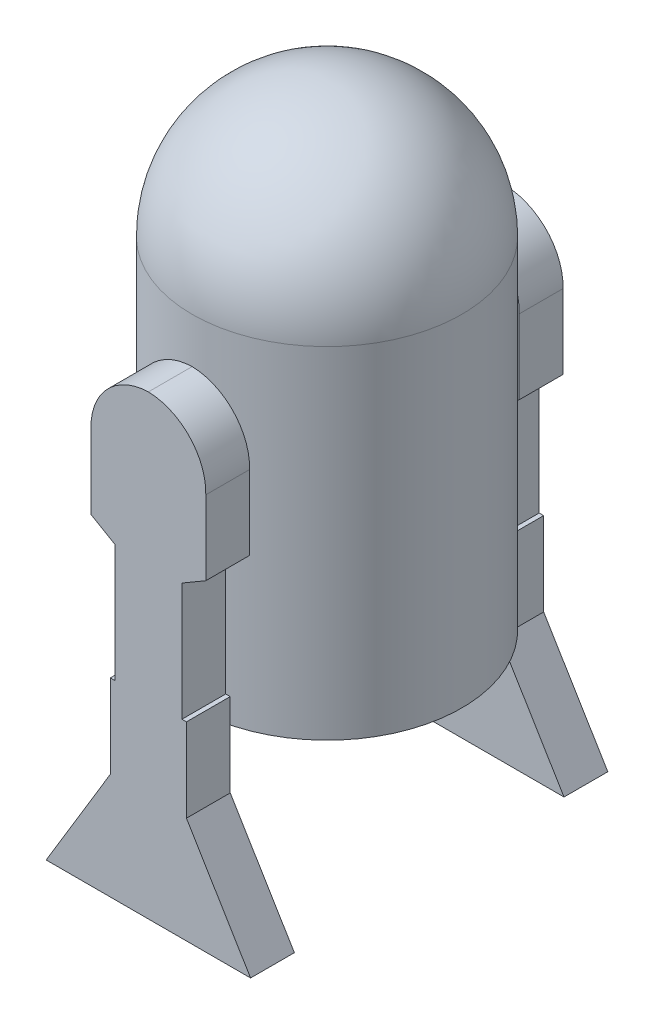
ISO-10303-21;
HEADER;
FILE_DESCRIPTION(('STEP AP214'),'2;1');
FILE_NAME('part.step','',(''),(''),'','','');
FILE_SCHEMA(('AUTOMOTIVE_DESIGN { 1 0 10303 214 1 1 1 1 }'));
ENDSEC;
DATA;
#1=APPLICATION_CONTEXT('core data for automotive mechanical design processes');
#2=APPLICATION_PROTOCOL_DEFINITION('international standard','automotive_design',2000,#1);
#3=PRODUCT_CONTEXT('',#1,'mechanical');
#4=PRODUCT('Part','Part','',(#3));
#5=PRODUCT_RELATED_PRODUCT_CATEGORY('part','',(#4));
#6=PRODUCT_DEFINITION_FORMATION('','',#4);
#7=PRODUCT_DEFINITION_CONTEXT('part definition',#1,'design');
#8=PRODUCT_DEFINITION('design','',#6,#7);
#9=PRODUCT_DEFINITION_SHAPE('','',#8);
#10=(LENGTH_UNIT() NAMED_UNIT(*) SI_UNIT(.MILLI.,.METRE.));
#11=(NAMED_UNIT(*) PLANE_ANGLE_UNIT() SI_UNIT($,.RADIAN.));
#12=(NAMED_UNIT(*) SI_UNIT($,.STERADIAN.) SOLID_ANGLE_UNIT());
#13=UNCERTAINTY_MEASURE_WITH_UNIT(LENGTH_MEASURE(1.E-05),#10,'distance_accuracy_value','');
#14=(GEOMETRIC_REPRESENTATION_CONTEXT(3) GLOBAL_UNCERTAINTY_ASSIGNED_CONTEXT((#13)) GLOBAL_UNIT_ASSIGNED_CONTEXT((#10,
#11,#12)) REPRESENTATION_CONTEXT('',''));
#15=CARTESIAN_POINT('',(0.,0.,0.));
#16=DIRECTION('',(0.,0.,1.));
#17=DIRECTION('',(1.,0.,0.));
#18=AXIS2_PLACEMENT_3D('',#15,#16,#17);
#19=CARTESIAN_POINT('',(2.62081152800423,683.452730750432,305.869874894946));
#20=DIRECTION('',(0.,0.,-1.));
#21=DIRECTION('',(1.,0.,0.));
#22=AXIS2_PLACEMENT_3D('',#19,#20,#21);
#23=CYLINDRICAL_SURFACE('',#22,100.957677938701);
#24=CARTESIAN_POINT('',(2.62081152800423,683.452730750432,230.869874894946));
#25=DIRECTION('',(0.,0.,-1.));
#26=DIRECTION('',(-1.,0.,0.));
#27=AXIS2_PLACEMENT_3D('',#24,#25,#26);
#28=CIRCLE('',#27,100.957677938701);
#29=CARTESIAN_POINT('',(-98.3028431903483,680.831919222428,230.869874894946));
#30=VERTEX_POINT('',#29);
#31=CARTESIAN_POINT('',(0.,784.376385468785,230.869874894946));
#32=VERTEX_POINT('',#31);
#33=EDGE_CURVE('E193',#30,#32,#28,.T.);
#34=ORIENTED_EDGE('',*,*,#33,.F.);
#35=DIRECTION('',(0.,0.,-1.));
#36=VECTOR('',#35,1.);
#37=CARTESIAN_POINT('',(-98.3028431903483,680.831919222428,305.869874894946));
#38=LINE('',#37,#36);
#39=CARTESIAN_POINT('',(-98.3028431903483,680.831919222428,305.869874894946));
#40=VERTEX_POINT('',#39);
#41=EDGE_CURVE('E192',#40,#30,#38,.T.);
#42=ORIENTED_EDGE('',*,*,#41,.F.);
#43=CARTESIAN_POINT('',(2.62081152800423,683.452730750432,305.869874894946));
#44=DIRECTION('',(0.,0.,-1.));
#45=DIRECTION('',(-1.,0.,0.));
#46=AXIS2_PLACEMENT_3D('',#43,#44,#45);
#47=CIRCLE('',#46,100.957677938701);
#48=CARTESIAN_POINT('',(0.,784.376385468785,305.869874894946));
#49=VERTEX_POINT('',#48);
#50=EDGE_CURVE('E232',#40,#49,#47,.T.);
#51=ORIENTED_EDGE('',*,*,#50,.T.);
#52=DIRECTION('',(0.,0.,-1.));
#53=VECTOR('',#52,1.);
#54=CARTESIAN_POINT('',(0.,784.376385468785,305.869874894946));
#55=LINE('',#54,#53);
#56=EDGE_CURVE('E12',#49,#32,#55,.T.);
#57=ORIENTED_EDGE('',*,*,#56,.T.);
#58=EDGE_LOOP('',(#34,#42,#51,#57));
#59=FACE_BOUND('',#58,.T.);
#60=ADVANCED_FACE('F55',(#59),#23,.T.);
#61=CARTESIAN_POINT('',(-2.62081152800423,683.452730750432,305.869874894946));
#62=DIRECTION('',(0.,0.,-1.));
#63=DIRECTION('',(1.,0.,0.));
#64=AXIS2_PLACEMENT_3D('',#61,#62,#63);
#65=CYLINDRICAL_SURFACE('',#64,100.957677938701);
#66=CARTESIAN_POINT('',(-2.62081152800423,683.452730750432,230.869874894946));
#67=DIRECTION('',(0.,0.,-1.));
#68=DIRECTION('',(1.,0.,0.));
#69=AXIS2_PLACEMENT_3D('',#66,#67,#68);
#70=CIRCLE('',#69,100.957677938701);
#71=CARTESIAN_POINT('',(98.3028431903483,680.831919222428,230.869874894946));
#72=VERTEX_POINT('',#71);
#73=EDGE_CURVE('E195',#32,#72,#70,.T.);
#74=ORIENTED_EDGE('',*,*,#73,.F.);
#75=ORIENTED_EDGE('',*,*,#56,.F.);
#76=CARTESIAN_POINT('',(-2.62081152800423,683.452730750432,305.869874894946));
#77=DIRECTION('',(0.,0.,-1.));
#78=DIRECTION('',(1.,0.,0.));
#79=AXIS2_PLACEMENT_3D('',#76,#77,#78);
#80=CIRCLE('',#79,100.957677938701);
#81=CARTESIAN_POINT('',(98.3028431903483,680.831919222428,305.869874894946));
#82=VERTEX_POINT('',#81);
#83=EDGE_CURVE('E130',#49,#82,#80,.T.);
#84=ORIENTED_EDGE('',*,*,#83,.T.);
#85=DIRECTION('',(0.,0.,-1.));
#86=VECTOR('',#85,1.);
#87=CARTESIAN_POINT('',(98.3028431903483,680.831919222428,305.869874894946));
#88=LINE('',#87,#86);
#89=EDGE_CURVE('E63',#82,#72,#88,.T.);
#90=ORIENTED_EDGE('',*,*,#89,.T.);
#91=EDGE_LOOP('',(#74,#75,#84,#90));
#92=FACE_BOUND('',#91,.T.);
#93=ADVANCED_FACE('F265',(#92),#65,.T.);
#94=CARTESIAN_POINT('',(98.3028431903483,680.831919222428,305.869874894946));
#95=DIRECTION('',(-1.,0.,0.));
#96=DIRECTION('',(0.,0.,-1.));
#97=AXIS2_PLACEMENT_3D('',#94,#95,#96);
#98=PLANE('',#97);
#99=DIRECTION('',(0.,-1.,0.));
#100=VECTOR('',#99,1.);
#101=CARTESIAN_POINT('',(98.3028431903483,680.831919222428,230.869874894946));
#102=LINE('',#101,#100);
#103=CARTESIAN_POINT('',(98.3028431903483,553.465340717842,230.869874894946));
#104=VERTEX_POINT('',#103);
#105=EDGE_CURVE('E198',#72,#104,#102,.T.);
#106=ORIENTED_EDGE('',*,*,#105,.F.);
#107=ORIENTED_EDGE('',*,*,#89,.F.);
#108=DIRECTION('',(0.,-1.,0.));
#109=VECTOR('',#108,1.);
#110=CARTESIAN_POINT('',(98.3028431903483,680.831919222428,305.869874894946));
#111=LINE('',#110,#109);
#112=CARTESIAN_POINT('',(98.3028431903483,553.465340717842,305.869874894946));
#113=VERTEX_POINT('',#112);
#114=EDGE_CURVE('E274',#82,#113,#111,.T.);
#115=ORIENTED_EDGE('',*,*,#114,.T.);
#116=DIRECTION('',(0.,0.,-1.));
#117=VECTOR('',#116,1.);
#118=CARTESIAN_POINT('',(98.3028431903483,553.465340717842,305.869874894946));
#119=LINE('',#118,#117);
#120=EDGE_CURVE('E260',#113,#104,#119,.T.);
#121=ORIENTED_EDGE('',*,*,#120,.T.);
#122=EDGE_LOOP('',(#106,#107,#115,#121));
#123=FACE_BOUND('',#122,.T.);
#124=ADVANCED_FACE('F326',(#123),#98,.F.);
#125=CARTESIAN_POINT('',(98.3028431903483,553.465340717842,305.869874894946));
#126=DIRECTION('',(-0.504427537965022,0.86345402827397,0.));
#127=DIRECTION('',(-0.86345402827397,-0.504427537965022,0.));
#128=AXIS2_PLACEMENT_3D('',#125,#126,#127);
#129=PLANE('',#128);
#130=DIRECTION('',(-0.86345402827397,-0.504427537965022,0.));
#131=VECTOR('',#130,1.);
#132=CARTESIAN_POINT('',(98.3028431903483,553.465340717842,230.869874894946));
#133=LINE('',#132,#131);
#134=CARTESIAN_POINT('',(57.4430910383442,529.595182602885,230.869874894946));
#135=VERTEX_POINT('',#134);
#136=EDGE_CURVE('E201',#104,#135,#133,.T.);
#137=ORIENTED_EDGE('',*,*,#136,.F.);
#138=ORIENTED_EDGE('',*,*,#120,.F.);
#139=DIRECTION('',(-0.86345402827397,-0.504427537965022,0.));
#140=VECTOR('',#139,1.);
#141=CARTESIAN_POINT('',(98.3028431903483,553.465340717842,305.869874894946));
#142=LINE('',#141,#140);
#143=CARTESIAN_POINT('',(57.4430910383442,529.595182602885,305.869874894946));
#144=VERTEX_POINT('',#143);
#145=EDGE_CURVE('E278',#113,#144,#142,.T.);
#146=ORIENTED_EDGE('',*,*,#145,.T.);
#147=DIRECTION('',(0.,0.,-1.));
#148=VECTOR('',#147,1.);
#149=CARTESIAN_POINT('',(57.4430910383442,529.595182602885,305.869874894946));
#150=LINE('',#149,#148);
#151=EDGE_CURVE('E257',#144,#135,#150,.T.);
#152=ORIENTED_EDGE('',*,*,#151,.T.);
#153=EDGE_LOOP('',(#137,#138,#146,#152));
#154=FACE_BOUND('',#153,.T.);
#155=ADVANCED_FACE('F325',(#154),#129,.F.);
#156=CARTESIAN_POINT('',(57.4430910383442,529.595182602885,305.869874894946));
#157=DIRECTION('',(-1.,0.,0.));
#158=DIRECTION('',(0.,0.,-1.));
#159=AXIS2_PLACEMENT_3D('',#156,#157,#158);
#160=PLANE('',#159);
#161=DIRECTION('',(0.,-1.,0.));
#162=VECTOR('',#161,1.);
#163=CARTESIAN_POINT('',(57.4430910383442,529.595182602885,230.869874894946));
#164=LINE('',#163,#162);
#165=CARTESIAN_POINT('',(57.4430910383442,327.575952081145,230.869874894946));
#166=VERTEX_POINT('',#165);
#167=EDGE_CURVE('E204',#135,#166,#164,.T.);
#168=ORIENTED_EDGE('',*,*,#167,.F.);
#169=ORIENTED_EDGE('',*,*,#151,.F.);
#170=DIRECTION('',(0.,-1.,0.));
#171=VECTOR('',#170,1.);
#172=CARTESIAN_POINT('',(57.4430910383442,529.595182602885,305.869874894946));
#173=LINE('',#172,#171);
#174=CARTESIAN_POINT('',(57.4430910383442,327.575952081145,305.869874894946));
#175=VERTEX_POINT('',#174);
#176=EDGE_CURVE('E281',#144,#175,#173,.T.);
#177=ORIENTED_EDGE('',*,*,#176,.T.);
#178=DIRECTION('',(0.,0.,-1.));
#179=VECTOR('',#178,1.);
#180=CARTESIAN_POINT('',(57.4430910383442,327.575952081145,305.869874894946));
#181=LINE('',#180,#179);
#182=EDGE_CURVE('E254',#175,#166,#181,.T.);
#183=ORIENTED_EDGE('',*,*,#182,.T.);
#184=EDGE_LOOP('',(#168,#169,#177,#183));
#185=FACE_BOUND('',#184,.T.);
#186=ADVANCED_FACE('F323',(#185),#160,.F.);
#187=CARTESIAN_POINT('',(57.4430910383442,327.575952081145,305.869874894946));
#188=DIRECTION('',(0.,-1.,0.));
#189=DIRECTION('',(0.,0.,1.));
#190=AXIS2_PLACEMENT_3D('',#187,#188,#189);
#191=PLANE('',#190);
#192=DIRECTION('',(1.,0.,0.));
#193=VECTOR('',#192,1.);
#194=CARTESIAN_POINT('',(57.4430910383442,327.575952081145,230.869874894946));
#195=LINE('',#194,#193);
#196=CARTESIAN_POINT('',(65.1517277548361,327.575952081145,230.869874894946));
#197=VERTEX_POINT('',#196);
#198=EDGE_CURVE('E207',#166,#197,#195,.T.);
#199=ORIENTED_EDGE('',*,*,#198,.F.);
#200=ORIENTED_EDGE('',*,*,#182,.F.);
#201=DIRECTION('',(1.,0.,0.));
#202=VECTOR('',#201,1.);
#203=CARTESIAN_POINT('',(57.4430910383442,327.575952081145,305.869874894946));
#204=LINE('',#203,#202);
#205=CARTESIAN_POINT('',(65.1517277548361,327.575952081145,305.869874894946));
#206=VERTEX_POINT('',#205);
#207=EDGE_CURVE('E284',#175,#206,#204,.T.);
#208=ORIENTED_EDGE('',*,*,#207,.T.);
#209=DIRECTION('',(0.,0.,-1.));
#210=VECTOR('',#209,1.);
#211=CARTESIAN_POINT('',(65.1517277548361,327.575952081145,305.869874894946));
#212=LINE('',#211,#210);
#213=EDGE_CURVE('E251',#206,#197,#212,.T.);
#214=ORIENTED_EDGE('',*,*,#213,.T.);
#215=EDGE_LOOP('',(#199,#200,#208,#214));
#216=FACE_BOUND('',#215,.T.);
#217=ADVANCED_FACE('F319',(#216),#191,.F.);
#218=CARTESIAN_POINT('',(65.1517277548361,327.575952081145,305.869874894946));
#219=DIRECTION('',(-1.,0.,0.));
#220=DIRECTION('',(0.,0.,-1.));
#221=AXIS2_PLACEMENT_3D('',#218,#219,#220);
#222=PLANE('',#221);
#223=DIRECTION('',(0.,-1.,0.));
#224=VECTOR('',#223,1.);
#225=CARTESIAN_POINT('',(65.1517277548361,327.575952081145,230.869874894946));
#226=LINE('',#225,#224);
#227=CARTESIAN_POINT('',(65.1517277548361,184.684592199182,230.869874894946));
#228=VERTEX_POINT('',#227);
#229=EDGE_CURVE('E210',#197,#228,#226,.T.);
#230=ORIENTED_EDGE('',*,*,#229,.F.);
#231=ORIENTED_EDGE('',*,*,#213,.F.);
#232=DIRECTION('',(0.,-1.,0.));
#233=VECTOR('',#232,1.);
#234=CARTESIAN_POINT('',(65.1517277548361,327.575952081145,305.869874894946));
#235=LINE('',#234,#233);
#236=CARTESIAN_POINT('',(65.1517277548361,184.684592199182,305.869874894946));
#237=VERTEX_POINT('',#236);
#238=EDGE_CURVE('E287',#206,#237,#235,.T.);
#239=ORIENTED_EDGE('',*,*,#238,.T.);
#240=DIRECTION('',(0.,0.,-1.));
#241=VECTOR('',#240,1.);
#242=CARTESIAN_POINT('',(65.1517277548361,184.684592199182,305.869874894946));
#243=LINE('',#242,#241);
#244=EDGE_CURVE('E248',#237,#228,#243,.T.);
#245=ORIENTED_EDGE('',*,*,#244,.T.);
#246=EDGE_LOOP('',(#230,#231,#239,#245));
#247=FACE_BOUND('',#246,.T.);
#248=ADVANCED_FACE('F316',(#247),#222,.F.);
#249=CARTESIAN_POINT('',(175.,2.63696693908866,305.869874894946));
#250=DIRECTION('',(-0.856204415699511,-0.51663720204478,0.));
#251=DIRECTION('',(0.51663720204478,-0.856204415699511,0.));
#252=AXIS2_PLACEMENT_3D('',#249,#250,#251);
#253=PLANE('',#252);
#254=DIRECTION('',(0.51663720204478,-0.856204415699511,0.));
#255=VECTOR('',#254,1.);
#256=CARTESIAN_POINT('',(175.,2.63696693908866,230.869874894946));
#257=LINE('',#256,#255);
#258=CARTESIAN_POINT('',(175.,2.63696693908866,230.869874894946));
#259=VERTEX_POINT('',#258);
#260=EDGE_CURVE('E213',#228,#259,#257,.T.);
#261=ORIENTED_EDGE('',*,*,#260,.F.);
#262=ORIENTED_EDGE('',*,*,#244,.F.);
#263=DIRECTION('',(0.51663720204478,-0.856204415699511,0.));
#264=VECTOR('',#263,1.);
#265=CARTESIAN_POINT('',(175.,2.63696693908866,305.869874894946));
#266=LINE('',#265,#264);
#267=CARTESIAN_POINT('',(175.,2.63696693908866,305.869874894946));
#268=VERTEX_POINT('',#267);
#269=EDGE_CURVE('E290',#237,#268,#266,.T.);
#270=ORIENTED_EDGE('',*,*,#269,.T.);
#271=DIRECTION('',(0.,0.,-1.));
#272=VECTOR('',#271,1.);
#273=CARTESIAN_POINT('',(175.,2.63696693908866,305.869874894946));
#274=LINE('',#273,#272);
#275=EDGE_CURVE('E245',#268,#259,#274,.T.);
#276=ORIENTED_EDGE('',*,*,#275,.T.);
#277=EDGE_LOOP('',(#261,#262,#270,#276));
#278=FACE_BOUND('',#277,.T.);
#279=ADVANCED_FACE('F314',(#278),#253,.F.);
#280=CARTESIAN_POINT('',(175.,2.63696693908866,305.869874894946));
#281=DIRECTION('',(0.,1.,0.));
#282=DIRECTION('',(0.,0.,-1.));
#283=AXIS2_PLACEMENT_3D('',#280,#281,#282);
#284=PLANE('',#283);
#285=DIRECTION('',(-1.,0.,0.));
#286=VECTOR('',#285,1.);
#287=CARTESIAN_POINT('',(175.,2.63696693908866,230.869874894946));
#288=LINE('',#287,#286);
#289=CARTESIAN_POINT('',(-175.,2.63696693908866,230.869874894946));
#290=VERTEX_POINT('',#289);
#291=EDGE_CURVE('E216',#259,#290,#288,.T.);
#292=ORIENTED_EDGE('',*,*,#291,.F.);
#293=ORIENTED_EDGE('',*,*,#275,.F.);
#294=DIRECTION('',(-1.,0.,0.));
#295=VECTOR('',#294,1.);
#296=CARTESIAN_POINT('',(175.,2.63696693908866,305.869874894946));
#297=LINE('',#296,#295);
#298=CARTESIAN_POINT('',(-175.,2.63696693908866,305.869874894946));
#299=VERTEX_POINT('',#298);
#300=EDGE_CURVE('E293',#268,#299,#297,.T.);
#301=ORIENTED_EDGE('',*,*,#300,.T.);
#302=DIRECTION('',(0.,0.,-1.));
#303=VECTOR('',#302,1.);
#304=CARTESIAN_POINT('',(-175.,2.63696693908866,305.869874894946));
#305=LINE('',#304,#303);
#306=EDGE_CURVE('E242',#299,#290,#305,.T.);
#307=ORIENTED_EDGE('',*,*,#306,.T.);
#308=EDGE_LOOP('',(#292,#293,#301,#307));
#309=FACE_BOUND('',#308,.T.);
#310=ADVANCED_FACE('F310',(#309),#284,.F.);
#311=CARTESIAN_POINT('',(-175.,2.63696693908866,305.869874894946));
#312=DIRECTION('',(0.856204415699511,-0.51663720204478,0.));
#313=DIRECTION('',(0.51663720204478,0.856204415699511,0.));
#314=AXIS2_PLACEMENT_3D('',#311,#312,#313);
#315=PLANE('',#314);
#316=DIRECTION('',(0.51663720204478,0.856204415699511,0.));
#317=VECTOR('',#316,1.);
#318=CARTESIAN_POINT('',(-175.,2.63696693908866,230.869874894946));
#319=LINE('',#318,#317);
#320=CARTESIAN_POINT('',(-65.1517277548361,184.684592199182,230.869874894946));
#321=VERTEX_POINT('',#320);
#322=EDGE_CURVE('E219',#290,#321,#319,.T.);
#323=ORIENTED_EDGE('',*,*,#322,.F.);
#324=ORIENTED_EDGE('',*,*,#306,.F.);
#325=DIRECTION('',(0.51663720204478,0.856204415699511,0.));
#326=VECTOR('',#325,1.);
#327=CARTESIAN_POINT('',(-175.,2.63696693908866,305.869874894946));
#328=LINE('',#327,#326);
#329=CARTESIAN_POINT('',(-65.1517277548361,184.684592199182,305.869874894946));
#330=VERTEX_POINT('',#329);
#331=EDGE_CURVE('E296',#299,#330,#328,.T.);
#332=ORIENTED_EDGE('',*,*,#331,.T.);
#333=DIRECTION('',(0.,0.,-1.));
#334=VECTOR('',#333,1.);
#335=CARTESIAN_POINT('',(-65.1517277548361,184.684592199182,305.869874894946));
#336=LINE('',#335,#334);
#337=EDGE_CURVE('E239',#330,#321,#336,.T.);
#338=ORIENTED_EDGE('',*,*,#337,.T.);
#339=EDGE_LOOP('',(#323,#324,#332,#338));
#340=FACE_BOUND('',#339,.T.);
#341=ADVANCED_FACE('F307',(#340),#315,.F.);
#342=CARTESIAN_POINT('',(-65.1517277548361,327.575952081145,305.869874894946));
#343=DIRECTION('',(1.,0.,0.));
#344=DIRECTION('',(0.,0.,1.));
#345=AXIS2_PLACEMENT_3D('',#342,#343,#344);
#346=PLANE('',#345);
#347=DIRECTION('',(0.,1.,0.));
#348=VECTOR('',#347,1.);
#349=CARTESIAN_POINT('',(-65.1517277548361,327.575952081145,230.869874894946));
#350=LINE('',#349,#348);
#351=CARTESIAN_POINT('',(-65.1517277548361,327.575952081145,230.869874894946));
#352=VERTEX_POINT('',#351);
#353=EDGE_CURVE('E222',#321,#352,#350,.T.);
#354=ORIENTED_EDGE('',*,*,#353,.F.);
#355=ORIENTED_EDGE('',*,*,#337,.F.);
#356=DIRECTION('',(0.,1.,0.));
#357=VECTOR('',#356,1.);
#358=CARTESIAN_POINT('',(-65.1517277548361,327.575952081145,305.869874894946));
#359=LINE('',#358,#357);
#360=CARTESIAN_POINT('',(-65.1517277548361,327.575952081145,305.869874894946));
#361=VERTEX_POINT('',#360);
#362=EDGE_CURVE('E187',#330,#361,#359,.T.);
#363=ORIENTED_EDGE('',*,*,#362,.T.);
#364=DIRECTION('',(0.,0.,-1.));
#365=VECTOR('',#364,1.);
#366=CARTESIAN_POINT('',(-65.1517277548361,327.575952081145,305.869874894946));
#367=LINE('',#366,#365);
#368=EDGE_CURVE('E236',#361,#352,#367,.T.);
#369=ORIENTED_EDGE('',*,*,#368,.T.);
#370=EDGE_LOOP('',(#354,#355,#363,#369));
#371=FACE_BOUND('',#370,.T.);
#372=ADVANCED_FACE('F301',(#371),#346,.F.);
#373=CARTESIAN_POINT('',(-57.4430910383442,327.575952081145,305.869874894946));
#374=DIRECTION('',(0.,-1.,0.));
#375=DIRECTION('',(0.,0.,1.));
#376=AXIS2_PLACEMENT_3D('',#373,#374,#375);
#377=PLANE('',#376);
#378=DIRECTION('',(1.,0.,0.));
#379=VECTOR('',#378,1.);
#380=CARTESIAN_POINT('',(-57.4430910383442,327.575952081145,230.869874894946));
#381=LINE('',#380,#379);
#382=CARTESIAN_POINT('',(-57.4430910383442,327.575952081145,230.869874894946));
#383=VERTEX_POINT('',#382);
#384=EDGE_CURVE('E225',#352,#383,#381,.T.);
#385=ORIENTED_EDGE('',*,*,#384,.F.);
#386=ORIENTED_EDGE('',*,*,#368,.F.);
#387=DIRECTION('',(1.,0.,0.));
#388=VECTOR('',#387,1.);
#389=CARTESIAN_POINT('',(-57.4430910383442,327.575952081145,305.869874894946));
#390=LINE('',#389,#388);
#391=CARTESIAN_POINT('',(-57.4430910383442,327.575952081145,305.869874894946));
#392=VERTEX_POINT('',#391);
#393=EDGE_CURVE('E185',#361,#392,#390,.T.);
#394=ORIENTED_EDGE('',*,*,#393,.T.);
#395=DIRECTION('',(0.,0.,-1.));
#396=VECTOR('',#395,1.);
#397=CARTESIAN_POINT('',(-57.4430910383442,327.575952081145,305.869874894946));
#398=LINE('',#397,#396);
#399=EDGE_CURVE('E179',#392,#383,#398,.T.);
#400=ORIENTED_EDGE('',*,*,#399,.T.);
#401=EDGE_LOOP('',(#385,#386,#394,#400));
#402=FACE_BOUND('',#401,.T.);
#403=ADVANCED_FACE('F305',(#402),#377,.F.);
#404=CARTESIAN_POINT('',(-57.4430910383442,529.595182602885,305.869874894946));
#405=DIRECTION('',(1.,0.,0.));
#406=DIRECTION('',(0.,0.,1.));
#407=AXIS2_PLACEMENT_3D('',#404,#405,#406);
#408=PLANE('',#407);
#409=DIRECTION('',(0.,1.,0.));
#410=VECTOR('',#409,1.);
#411=CARTESIAN_POINT('',(-57.4430910383442,529.595182602885,230.869874894946));
#412=LINE('',#411,#410);
#413=CARTESIAN_POINT('',(-57.4430910383442,529.595182602885,230.869874894946));
#414=VERTEX_POINT('',#413);
#415=EDGE_CURVE('E228',#383,#414,#412,.T.);
#416=ORIENTED_EDGE('',*,*,#415,.F.);
#417=ORIENTED_EDGE('',*,*,#399,.F.);
#418=DIRECTION('',(0.,1.,0.));
#419=VECTOR('',#418,1.);
#420=CARTESIAN_POINT('',(-57.4430910383442,529.595182602885,305.869874894946));
#421=LINE('',#420,#419);
#422=CARTESIAN_POINT('',(-57.4430910383442,529.595182602885,305.869874894946));
#423=VERTEX_POINT('',#422);
#424=EDGE_CURVE('E169',#392,#423,#421,.T.);
#425=ORIENTED_EDGE('',*,*,#424,.T.);
#426=DIRECTION('',(0.,0.,-1.));
#427=VECTOR('',#426,1.);
#428=CARTESIAN_POINT('',(-57.4430910383442,529.595182602885,305.869874894946));
#429=LINE('',#428,#427);
#430=EDGE_CURVE('E174',#423,#414,#429,.T.);
#431=ORIENTED_EDGE('',*,*,#430,.T.);
#432=EDGE_LOOP('',(#416,#417,#425,#431));
#433=FACE_BOUND('',#432,.T.);
#434=ADVANCED_FACE('F182',(#433),#408,.F.);
#435=CARTESIAN_POINT('',(-98.3028431903483,553.465340717842,305.869874894946));
#436=DIRECTION('',(0.504427537965022,0.86345402827397,0.));
#437=DIRECTION('',(-0.86345402827397,0.504427537965022,0.));
#438=AXIS2_PLACEMENT_3D('',#435,#436,#437);
#439=PLANE('',#438);
#440=DIRECTION('',(-0.86345402827397,0.504427537965022,0.));
#441=VECTOR('',#440,1.);
#442=CARTESIAN_POINT('',(-98.3028431903483,553.465340717842,230.869874894946));
#443=LINE('',#442,#441);
#444=CARTESIAN_POINT('',(-98.3028431903483,553.465340717842,230.869874894946));
#445=VERTEX_POINT('',#444);
#446=EDGE_CURVE('E176',#414,#445,#443,.T.);
#447=ORIENTED_EDGE('',*,*,#446,.F.);
#448=ORIENTED_EDGE('',*,*,#430,.F.);
#449=DIRECTION('',(-0.86345402827397,0.504427537965022,0.));
#450=VECTOR('',#449,1.);
#451=CARTESIAN_POINT('',(-98.3028431903483,553.465340717842,305.869874894946));
#452=LINE('',#451,#450);
#453=CARTESIAN_POINT('',(-98.3028431903483,553.465340717842,305.869874894946));
#454=VERTEX_POINT('',#453);
#455=EDGE_CURVE('E165',#423,#454,#452,.T.);
#456=ORIENTED_EDGE('',*,*,#455,.T.);
#457=DIRECTION('',(0.,0.,-1.));
#458=VECTOR('',#457,1.);
#459=CARTESIAN_POINT('',(-98.3028431903483,553.465340717842,305.869874894946));
#460=LINE('',#459,#458);
#461=EDGE_CURVE('E180',#454,#445,#460,.T.);
#462=ORIENTED_EDGE('',*,*,#461,.T.);
#463=EDGE_LOOP('',(#447,#448,#456,#462));
#464=FACE_BOUND('',#463,.T.);
#465=ADVANCED_FACE('F175',(#464),#439,.F.);
#466=CARTESIAN_POINT('',(-98.3028431903483,680.831919222428,305.869874894946));
#467=DIRECTION('',(1.,0.,0.));
#468=DIRECTION('',(0.,0.,1.));
#469=AXIS2_PLACEMENT_3D('',#466,#467,#468);
#470=PLANE('',#469);
#471=DIRECTION('',(0.,1.,0.));
#472=VECTOR('',#471,1.);
#473=CARTESIAN_POINT('',(-98.3028431903483,680.831919222428,230.869874894946));
#474=LINE('',#473,#472);
#475=EDGE_CURVE('E118',#445,#30,#474,.T.);
#476=ORIENTED_EDGE('',*,*,#475,.F.);
#477=ORIENTED_EDGE('',*,*,#461,.F.);
#478=DIRECTION('',(0.,1.,0.));
#479=VECTOR('',#478,1.);
#480=CARTESIAN_POINT('',(-98.3028431903483,680.831919222428,305.869874894946));
#481=LINE('',#480,#479);
#482=EDGE_CURVE('E71',#454,#40,#481,.T.);
#483=ORIENTED_EDGE('',*,*,#482,.T.);
#484=ORIENTED_EDGE('',*,*,#41,.T.);
#485=EDGE_LOOP('',(#476,#477,#483,#484));
#486=FACE_BOUND('',#485,.T.);
#487=ADVANCED_FACE('F432',(#486),#470,.F.);
#488=CARTESIAN_POINT('',(2.62081152800423,683.452730750432,305.869874894946));
#489=DIRECTION('',(0.,0.,1.));
#490=DIRECTION('',(-1.,0.,0.));
#491=AXIS2_PLACEMENT_3D('',#488,#489,#490);
#492=PLANE('',#491);
#493=ORIENTED_EDGE('',*,*,#50,.F.);
#494=ORIENTED_EDGE('',*,*,#482,.F.);
#495=ORIENTED_EDGE('',*,*,#455,.F.);
#496=ORIENTED_EDGE('',*,*,#424,.F.);
#497=ORIENTED_EDGE('',*,*,#393,.F.);
#498=ORIENTED_EDGE('',*,*,#362,.F.);
#499=ORIENTED_EDGE('',*,*,#331,.F.);
#500=ORIENTED_EDGE('',*,*,#300,.F.);
#501=ORIENTED_EDGE('',*,*,#269,.F.);
#502=ORIENTED_EDGE('',*,*,#238,.F.);
#503=ORIENTED_EDGE('',*,*,#207,.F.);
#504=ORIENTED_EDGE('',*,*,#176,.F.);
#505=ORIENTED_EDGE('',*,*,#145,.F.);
#506=ORIENTED_EDGE('',*,*,#114,.F.);
#507=ORIENTED_EDGE('',*,*,#83,.F.);
#508=EDGE_LOOP('',(#493,#494,#495,#496,#497,#498,#499,#500,#501,#502,#503,#504,#505,#506,#507));
#509=FACE_BOUND('',#508,.T.);
#510=ADVANCED_FACE('F167',(#509),#492,.T.);
#511=CARTESIAN_POINT('',(2.62081152800423,683.452730750432,230.869874894946));
#512=DIRECTION('',(0.,0.,1.));
#513=DIRECTION('',(-1.,0.,0.));
#514=AXIS2_PLACEMENT_3D('',#511,#512,#513);
#515=PLANE('',#514);
#516=ORIENTED_EDGE('',*,*,#33,.T.);
#517=ORIENTED_EDGE('',*,*,#73,.T.);
#518=ORIENTED_EDGE('',*,*,#105,.T.);
#519=ORIENTED_EDGE('',*,*,#136,.T.);
#520=ORIENTED_EDGE('',*,*,#167,.T.);
#521=ORIENTED_EDGE('',*,*,#198,.T.);
#522=ORIENTED_EDGE('',*,*,#229,.T.);
#523=ORIENTED_EDGE('',*,*,#260,.T.);
#524=ORIENTED_EDGE('',*,*,#291,.T.);
#525=ORIENTED_EDGE('',*,*,#322,.T.);
#526=ORIENTED_EDGE('',*,*,#353,.T.);
#527=ORIENTED_EDGE('',*,*,#384,.T.);
#528=ORIENTED_EDGE('',*,*,#415,.T.);
#529=ORIENTED_EDGE('',*,*,#446,.T.);
#530=ORIENTED_EDGE('',*,*,#475,.T.);
#531=EDGE_LOOP('',(#516,#517,#518,#519,#520,#521,#522,#523,#524,#525,#526,#527,#528,#529,#530));
#532=FACE_BOUND('',#531,.T.);
#533=ADVANCED_FACE('F268',(#532),#515,.F.);
#534=CLOSED_SHELL('',(#60,#93,#124,#155,#186,#217,#248,#279,#310,#341,#372,#403,#434,#465,#487,
#510,#533));
#535=MANIFOLD_SOLID_BREP('B2',#534);
#536=CARTESIAN_POINT('',(2.62081152800423,683.452730750432,-305.869874894946));
#537=DIRECTION('',(0.,0.,1.));
#538=DIRECTION('',(1.,0.,0.));
#539=AXIS2_PLACEMENT_3D('',#536,#537,#538);
#540=CYLINDRICAL_SURFACE('',#539,100.957677938701);
#541=CARTESIAN_POINT('',(2.62081152800423,683.452730750432,-230.869874894946));
#542=DIRECTION('',(0.,0.,-1.));
#543=DIRECTION('',(-1.,0.,0.));
#544=AXIS2_PLACEMENT_3D('',#541,#542,#543);
#545=CIRCLE('',#544,100.957677938701);
#546=CARTESIAN_POINT('',(-98.3028431903483,680.831919222428,-230.869874894946));
#547=VERTEX_POINT('',#546);
#548=CARTESIAN_POINT('',(0.,784.376385468785,-230.869874894946));
#549=VERTEX_POINT('',#548);
#550=EDGE_CURVE('E615',#547,#549,#545,.T.);
#551=ORIENTED_EDGE('',*,*,#550,.T.);
#552=DIRECTION('',(0.,0.,1.));
#553=VECTOR('',#552,1.);
#554=CARTESIAN_POINT('',(0.,784.376385468785,-305.869874894946));
#555=LINE('',#554,#553);
#556=CARTESIAN_POINT('',(0.,784.376385468785,-305.869874894946));
#557=VERTEX_POINT('',#556);
#558=EDGE_CURVE('E53',#557,#549,#555,.T.);
#559=ORIENTED_EDGE('',*,*,#558,.F.);
#560=CARTESIAN_POINT('',(2.62081152800423,683.452730750432,-305.869874894946));
#561=DIRECTION('',(0.,0.,-1.));
#562=DIRECTION('',(-1.,0.,0.));
#563=AXIS2_PLACEMENT_3D('',#560,#561,#562);
#564=CIRCLE('',#563,100.957677938701);
#565=CARTESIAN_POINT('',(-98.3028431903483,680.831919222428,-305.869874894946));
#566=VERTEX_POINT('',#565);
#567=EDGE_CURVE('E643',#566,#557,#564,.T.);
#568=ORIENTED_EDGE('',*,*,#567,.F.);
#569=DIRECTION('',(0.,0.,1.));
#570=VECTOR('',#569,1.);
#571=CARTESIAN_POINT('',(-98.3028431903483,680.831919222428,-305.869874894946));
#572=LINE('',#571,#570);
#573=EDGE_CURVE('E611',#566,#547,#572,.T.);
#574=ORIENTED_EDGE('',*,*,#573,.T.);
#575=EDGE_LOOP('',(#551,#559,#568,#574));
#576=FACE_BOUND('',#575,.T.);
#577=ADVANCED_FACE('F477',(#576),#540,.T.);
#578=CARTESIAN_POINT('',(-2.62081152800423,683.452730750432,-305.869874894946));
#579=DIRECTION('',(0.,0.,1.));
#580=DIRECTION('',(1.,0.,0.));
#581=AXIS2_PLACEMENT_3D('',#578,#579,#580);
#582=CYLINDRICAL_SURFACE('',#581,100.957677938701);
#583=CARTESIAN_POINT('',(-2.62081152800423,683.452730750432,-230.869874894946));
#584=DIRECTION('',(0.,0.,-1.));
#585=DIRECTION('',(1.,0.,0.));
#586=AXIS2_PLACEMENT_3D('',#583,#584,#585);
#587=CIRCLE('',#586,100.957677938701);
#588=CARTESIAN_POINT('',(98.3028431903483,680.831919222428,-230.869874894946));
#589=VERTEX_POINT('',#588);
#590=EDGE_CURVE('E618',#549,#589,#587,.T.);
#591=ORIENTED_EDGE('',*,*,#590,.T.);
#592=DIRECTION('',(0.,0.,1.));
#593=VECTOR('',#592,1.);
#594=CARTESIAN_POINT('',(98.3028431903483,680.831919222428,-305.869874894946));
#595=LINE('',#594,#593);
#596=CARTESIAN_POINT('',(98.3028431903483,680.831919222428,-305.869874894946));
#597=VERTEX_POINT('',#596);
#598=EDGE_CURVE('E485',#597,#589,#595,.T.);
#599=ORIENTED_EDGE('',*,*,#598,.F.);
#600=CARTESIAN_POINT('',(-2.62081152800423,683.452730750432,-305.869874894946));
#601=DIRECTION('',(0.,0.,-1.));
#602=DIRECTION('',(1.,0.,0.));
#603=AXIS2_PLACEMENT_3D('',#600,#601,#602);
#604=CIRCLE('',#603,100.957677938701);
#605=EDGE_CURVE('E557',#557,#597,#604,.T.);
#606=ORIENTED_EDGE('',*,*,#605,.F.);
#607=ORIENTED_EDGE('',*,*,#558,.T.);
#608=EDGE_LOOP('',(#591,#599,#606,#607));
#609=FACE_BOUND('',#608,.T.);
#610=ADVANCED_FACE('F736',(#609),#582,.T.);
#611=CARTESIAN_POINT('',(98.3028431903483,680.831919222428,-305.869874894946));
#612=DIRECTION('',(-1.,0.,0.));
#613=DIRECTION('',(0.,0.,1.));
#614=AXIS2_PLACEMENT_3D('',#611,#612,#613);
#615=PLANE('',#614);
#616=DIRECTION('',(0.,-1.,0.));
#617=VECTOR('',#616,1.);
#618=CARTESIAN_POINT('',(98.3028431903483,680.831919222428,-230.869874894946));
#619=LINE('',#618,#617);
#620=CARTESIAN_POINT('',(98.3028431903483,553.465340717842,-230.869874894946));
#621=VERTEX_POINT('',#620);
#622=EDGE_CURVE('E620',#589,#621,#619,.T.);
#623=ORIENTED_EDGE('',*,*,#622,.T.);
#624=DIRECTION('',(0.,0.,1.));
#625=VECTOR('',#624,1.);
#626=CARTESIAN_POINT('',(98.3028431903483,553.465340717842,-305.869874894946));
#627=LINE('',#626,#625);
#628=CARTESIAN_POINT('',(98.3028431903483,553.465340717842,-305.869874894946));
#629=VERTEX_POINT('',#628);
#630=EDGE_CURVE('E671',#629,#621,#627,.T.);
#631=ORIENTED_EDGE('',*,*,#630,.F.);
#632=DIRECTION('',(0.,-1.,0.));
#633=VECTOR('',#632,1.);
#634=CARTESIAN_POINT('',(98.3028431903483,680.831919222428,-305.869874894946));
#635=LINE('',#634,#633);
#636=EDGE_CURVE('E679',#597,#629,#635,.T.);
#637=ORIENTED_EDGE('',*,*,#636,.F.);
#638=ORIENTED_EDGE('',*,*,#598,.T.);
#639=EDGE_LOOP('',(#623,#631,#637,#638));
#640=FACE_BOUND('',#639,.T.);
#641=ADVANCED_FACE('F677',(#640),#615,.F.);
#642=CARTESIAN_POINT('',(98.3028431903483,553.465340717842,-305.869874894946));
#643=DIRECTION('',(-0.504427537965022,0.86345402827397,0.));
#644=DIRECTION('',(-0.86345402827397,-0.504427537965022,0.));
#645=AXIS2_PLACEMENT_3D('',#642,#643,#644);
#646=PLANE('',#645);
#647=DIRECTION('',(-0.86345402827397,-0.504427537965022,0.));
#648=VECTOR('',#647,1.);
#649=CARTESIAN_POINT('',(98.3028431903483,553.465340717842,-230.869874894946));
#650=LINE('',#649,#648);
#651=CARTESIAN_POINT('',(57.4430910383442,529.595182602885,-230.869874894946));
#652=VERTEX_POINT('',#651);
#653=EDGE_CURVE('E622',#621,#652,#650,.T.);
#654=ORIENTED_EDGE('',*,*,#653,.T.);
#655=DIRECTION('',(0.,0.,1.));
#656=VECTOR('',#655,1.);
#657=CARTESIAN_POINT('',(57.4430910383442,529.595182602885,-305.869874894946));
#658=LINE('',#657,#656);
#659=CARTESIAN_POINT('',(57.4430910383442,529.595182602885,-305.869874894946));
#660=VERTEX_POINT('',#659);
#661=EDGE_CURVE('E668',#660,#652,#658,.T.);
#662=ORIENTED_EDGE('',*,*,#661,.F.);
#663=DIRECTION('',(-0.86345402827397,-0.504427537965022,0.));
#664=VECTOR('',#663,1.);
#665=CARTESIAN_POINT('',(98.3028431903483,553.465340717842,-305.869874894946));
#666=LINE('',#665,#664);
#667=EDGE_CURVE('E697',#629,#660,#666,.T.);
#668=ORIENTED_EDGE('',*,*,#667,.F.);
#669=ORIENTED_EDGE('',*,*,#630,.T.);
#670=EDGE_LOOP('',(#654,#662,#668,#669));
#671=FACE_BOUND('',#670,.T.);
#672=ADVANCED_FACE('F688',(#671),#646,.F.);
#673=CARTESIAN_POINT('',(57.4430910383442,529.595182602885,-305.869874894946));
#674=DIRECTION('',(-1.,0.,0.));
#675=DIRECTION('',(0.,0.,1.));
#676=AXIS2_PLACEMENT_3D('',#673,#674,#675);
#677=PLANE('',#676);
#678=DIRECTION('',(0.,-1.,0.));
#679=VECTOR('',#678,1.);
#680=CARTESIAN_POINT('',(57.4430910383442,529.595182602885,-230.869874894946));
#681=LINE('',#680,#679);
#682=CARTESIAN_POINT('',(57.4430910383442,327.575952081145,-230.869874894946));
#683=VERTEX_POINT('',#682);
#684=EDGE_CURVE('E624',#652,#683,#681,.T.);
#685=ORIENTED_EDGE('',*,*,#684,.T.);
#686=DIRECTION('',(0.,0.,1.));
#687=VECTOR('',#686,1.);
#688=CARTESIAN_POINT('',(57.4430910383442,327.575952081145,-305.869874894946));
#689=LINE('',#688,#687);
#690=CARTESIAN_POINT('',(57.4430910383442,327.575952081145,-305.869874894946));
#691=VERTEX_POINT('',#690);
#692=EDGE_CURVE('E665',#691,#683,#689,.T.);
#693=ORIENTED_EDGE('',*,*,#692,.F.);
#694=DIRECTION('',(0.,-1.,0.));
#695=VECTOR('',#694,1.);
#696=CARTESIAN_POINT('',(57.4430910383442,529.595182602885,-305.869874894946));
#697=LINE('',#696,#695);
#698=EDGE_CURVE('E694',#660,#691,#697,.T.);
#699=ORIENTED_EDGE('',*,*,#698,.F.);
#700=ORIENTED_EDGE('',*,*,#661,.T.);
#701=EDGE_LOOP('',(#685,#693,#699,#700));
#702=FACE_BOUND('',#701,.T.);
#703=ADVANCED_FACE('F692',(#702),#677,.F.);
#704=CARTESIAN_POINT('',(57.4430910383442,327.575952081145,-305.869874894946));
#705=DIRECTION('',(0.,-1.,0.));
#706=DIRECTION('',(0.,0.,-1.));
#707=AXIS2_PLACEMENT_3D('',#704,#705,#706);
#708=PLANE('',#707);
#709=DIRECTION('',(1.,0.,0.));
#710=VECTOR('',#709,1.);
#711=CARTESIAN_POINT('',(57.4430910383442,327.575952081145,-230.869874894946));
#712=LINE('',#711,#710);
#713=CARTESIAN_POINT('',(65.1517277548361,327.575952081145,-230.869874894946));
#714=VERTEX_POINT('',#713);
#715=EDGE_CURVE('E626',#683,#714,#712,.T.);
#716=ORIENTED_EDGE('',*,*,#715,.T.);
#717=DIRECTION('',(0.,0.,1.));
#718=VECTOR('',#717,1.);
#719=CARTESIAN_POINT('',(65.1517277548361,327.575952081145,-305.869874894946));
#720=LINE('',#719,#718);
#721=CARTESIAN_POINT('',(65.1517277548361,327.575952081145,-305.869874894946));
#722=VERTEX_POINT('',#721);
#723=EDGE_CURVE('E662',#722,#714,#720,.T.);
#724=ORIENTED_EDGE('',*,*,#723,.F.);
#725=DIRECTION('',(1.,0.,0.));
#726=VECTOR('',#725,1.);
#727=CARTESIAN_POINT('',(57.4430910383442,327.575952081145,-305.869874894946));
#728=LINE('',#727,#726);
#729=EDGE_CURVE('E696',#691,#722,#728,.T.);
#730=ORIENTED_EDGE('',*,*,#729,.F.);
#731=ORIENTED_EDGE('',*,*,#692,.T.);
#732=EDGE_LOOP('',(#716,#724,#730,#731));
#733=FACE_BOUND('',#732,.T.);
#734=ADVANCED_FACE('F749',(#733),#708,.F.);
#735=CARTESIAN_POINT('',(65.1517277548361,327.575952081145,-305.869874894946));
#736=DIRECTION('',(-1.,0.,0.));
#737=DIRECTION('',(0.,0.,1.));
#738=AXIS2_PLACEMENT_3D('',#735,#736,#737);
#739=PLANE('',#738);
#740=DIRECTION('',(0.,-1.,0.));
#741=VECTOR('',#740,1.);
#742=CARTESIAN_POINT('',(65.1517277548361,327.575952081145,-230.869874894946));
#743=LINE('',#742,#741);
#744=CARTESIAN_POINT('',(65.1517277548361,184.684592199182,-230.869874894946));
#745=VERTEX_POINT('',#744);
#746=EDGE_CURVE('E628',#714,#745,#743,.T.);
#747=ORIENTED_EDGE('',*,*,#746,.T.);
#748=DIRECTION('',(0.,0.,1.));
#749=VECTOR('',#748,1.);
#750=CARTESIAN_POINT('',(65.1517277548361,184.684592199182,-305.869874894946));
#751=LINE('',#750,#749);
#752=CARTESIAN_POINT('',(65.1517277548361,184.684592199182,-305.869874894946));
#753=VERTEX_POINT('',#752);
#754=EDGE_CURVE('E659',#753,#745,#751,.T.);
#755=ORIENTED_EDGE('',*,*,#754,.F.);
#756=DIRECTION('',(0.,-1.,0.));
#757=VECTOR('',#756,1.);
#758=CARTESIAN_POINT('',(65.1517277548361,327.575952081145,-305.869874894946));
#759=LINE('',#758,#757);
#760=EDGE_CURVE('E699',#722,#753,#759,.T.);
#761=ORIENTED_EDGE('',*,*,#760,.F.);
#762=ORIENTED_EDGE('',*,*,#723,.T.);
#763=EDGE_LOOP('',(#747,#755,#761,#762));
#764=FACE_BOUND('',#763,.T.);
#765=ADVANCED_FACE('F752',(#764),#739,.F.);
#766=CARTESIAN_POINT('',(175.,2.63696693908866,-305.869874894946));
#767=DIRECTION('',(-0.856204415699511,-0.51663720204478,0.));
#768=DIRECTION('',(0.51663720204478,-0.856204415699511,0.));
#769=AXIS2_PLACEMENT_3D('',#766,#767,#768);
#770=PLANE('',#769);
#771=DIRECTION('',(0.51663720204478,-0.856204415699511,0.));
#772=VECTOR('',#771,1.);
#773=CARTESIAN_POINT('',(175.,2.63696693908866,-230.869874894946));
#774=LINE('',#773,#772);
#775=CARTESIAN_POINT('',(175.,2.63696693908866,-230.869874894946));
#776=VERTEX_POINT('',#775);
#777=EDGE_CURVE('E630',#745,#776,#774,.T.);
#778=ORIENTED_EDGE('',*,*,#777,.T.);
#779=DIRECTION('',(0.,0.,1.));
#780=VECTOR('',#779,1.);
#781=CARTESIAN_POINT('',(175.,2.63696693908866,-305.869874894946));
#782=LINE('',#781,#780);
#783=CARTESIAN_POINT('',(175.,2.63696693908866,-305.869874894946));
#784=VERTEX_POINT('',#783);
#785=EDGE_CURVE('E656',#784,#776,#782,.T.);
#786=ORIENTED_EDGE('',*,*,#785,.F.);
#787=DIRECTION('',(0.51663720204478,-0.856204415699511,0.));
#788=VECTOR('',#787,1.);
#789=CARTESIAN_POINT('',(175.,2.63696693908866,-305.869874894946));
#790=LINE('',#789,#788);
#791=EDGE_CURVE('E705',#753,#784,#790,.T.);
#792=ORIENTED_EDGE('',*,*,#791,.F.);
#793=ORIENTED_EDGE('',*,*,#754,.T.);
#794=EDGE_LOOP('',(#778,#786,#792,#793));
#795=FACE_BOUND('',#794,.T.);
#796=ADVANCED_FACE('F756',(#795),#770,.F.);
#797=CARTESIAN_POINT('',(175.,2.63696693908866,-305.869874894946));
#798=DIRECTION('',(0.,1.,0.));
#799=DIRECTION('',(0.,0.,1.));
#800=AXIS2_PLACEMENT_3D('',#797,#798,#799);
#801=PLANE('',#800);
#802=DIRECTION('',(-1.,0.,0.));
#803=VECTOR('',#802,1.);
#804=CARTESIAN_POINT('',(175.,2.63696693908866,-230.869874894946));
#805=LINE('',#804,#803);
#806=CARTESIAN_POINT('',(-175.,2.63696693908866,-230.869874894946));
#807=VERTEX_POINT('',#806);
#808=EDGE_CURVE('E632',#776,#807,#805,.T.);
#809=ORIENTED_EDGE('',*,*,#808,.T.);
#810=DIRECTION('',(0.,0.,1.));
#811=VECTOR('',#810,1.);
#812=CARTESIAN_POINT('',(-175.,2.63696693908866,-305.869874894946));
#813=LINE('',#812,#811);
#814=CARTESIAN_POINT('',(-175.,2.63696693908866,-305.869874894946));
#815=VERTEX_POINT('',#814);
#816=EDGE_CURVE('E653',#815,#807,#813,.T.);
#817=ORIENTED_EDGE('',*,*,#816,.F.);
#818=DIRECTION('',(-1.,0.,0.));
#819=VECTOR('',#818,1.);
#820=CARTESIAN_POINT('',(175.,2.63696693908866,-305.869874894946));
#821=LINE('',#820,#819);
#822=EDGE_CURVE('E707',#784,#815,#821,.T.);
#823=ORIENTED_EDGE('',*,*,#822,.F.);
#824=ORIENTED_EDGE('',*,*,#785,.T.);
#825=EDGE_LOOP('',(#809,#817,#823,#824));
#826=FACE_BOUND('',#825,.T.);
#827=ADVANCED_FACE('F760',(#826),#801,.F.);
#828=CARTESIAN_POINT('',(-175.,2.63696693908866,-305.869874894946));
#829=DIRECTION('',(0.856204415699511,-0.51663720204478,0.));
#830=DIRECTION('',(0.51663720204478,0.856204415699511,0.));
#831=AXIS2_PLACEMENT_3D('',#828,#829,#830);
#832=PLANE('',#831);
#833=DIRECTION('',(0.51663720204478,0.856204415699511,0.));
#834=VECTOR('',#833,1.);
#835=CARTESIAN_POINT('',(-175.,2.63696693908866,-230.869874894946));
#836=LINE('',#835,#834);
#837=CARTESIAN_POINT('',(-65.1517277548361,184.684592199182,-230.869874894946));
#838=VERTEX_POINT('',#837);
#839=EDGE_CURVE('E634',#807,#838,#836,.T.);
#840=ORIENTED_EDGE('',*,*,#839,.T.);
#841=DIRECTION('',(0.,0.,1.));
#842=VECTOR('',#841,1.);
#843=CARTESIAN_POINT('',(-65.1517277548361,184.684592199182,-305.869874894946));
#844=LINE('',#843,#842);
#845=CARTESIAN_POINT('',(-65.1517277548361,184.684592199182,-305.869874894946));
#846=VERTEX_POINT('',#845);
#847=EDGE_CURVE('E650',#846,#838,#844,.T.);
#848=ORIENTED_EDGE('',*,*,#847,.F.);
#849=DIRECTION('',(0.51663720204478,0.856204415699511,0.));
#850=VECTOR('',#849,1.);
#851=CARTESIAN_POINT('',(-175.,2.63696693908866,-305.869874894946));
#852=LINE('',#851,#850);
#853=EDGE_CURVE('E709',#815,#846,#852,.T.);
#854=ORIENTED_EDGE('',*,*,#853,.F.);
#855=ORIENTED_EDGE('',*,*,#816,.T.);
#856=EDGE_LOOP('',(#840,#848,#854,#855));
#857=FACE_BOUND('',#856,.T.);
#858=ADVANCED_FACE('F764',(#857),#832,.F.);
#859=CARTESIAN_POINT('',(-65.1517277548361,327.575952081145,-305.869874894946));
#860=DIRECTION('',(1.,0.,0.));
#861=DIRECTION('',(0.,0.,-1.));
#862=AXIS2_PLACEMENT_3D('',#859,#860,#861);
#863=PLANE('',#862);
#864=DIRECTION('',(0.,1.,0.));
#865=VECTOR('',#864,1.);
#866=CARTESIAN_POINT('',(-65.1517277548361,327.575952081145,-230.869874894946));
#867=LINE('',#866,#865);
#868=CARTESIAN_POINT('',(-65.1517277548361,327.575952081145,-230.869874894946));
#869=VERTEX_POINT('',#868);
#870=EDGE_CURVE('E636',#838,#869,#867,.T.);
#871=ORIENTED_EDGE('',*,*,#870,.T.);
#872=DIRECTION('',(0.,0.,1.));
#873=VECTOR('',#872,1.);
#874=CARTESIAN_POINT('',(-65.1517277548361,327.575952081145,-305.869874894946));
#875=LINE('',#874,#873);
#876=CARTESIAN_POINT('',(-65.1517277548361,327.575952081145,-305.869874894946));
#877=VERTEX_POINT('',#876);
#878=EDGE_CURVE('E647',#877,#869,#875,.T.);
#879=ORIENTED_EDGE('',*,*,#878,.F.);
#880=DIRECTION('',(0.,1.,0.));
#881=VECTOR('',#880,1.);
#882=CARTESIAN_POINT('',(-65.1517277548361,327.575952081145,-305.869874894946));
#883=LINE('',#882,#881);
#884=EDGE_CURVE('E711',#846,#877,#883,.T.);
#885=ORIENTED_EDGE('',*,*,#884,.F.);
#886=ORIENTED_EDGE('',*,*,#847,.T.);
#887=EDGE_LOOP('',(#871,#879,#885,#886));
#888=FACE_BOUND('',#887,.T.);
#889=ADVANCED_FACE('F717',(#888),#863,.F.);
#890=CARTESIAN_POINT('',(-57.4430910383442,327.575952081145,-305.869874894946));
#891=DIRECTION('',(0.,-1.,0.));
#892=DIRECTION('',(0.,0.,-1.));
#893=AXIS2_PLACEMENT_3D('',#890,#891,#892);
#894=PLANE('',#893);
#895=DIRECTION('',(1.,0.,0.));
#896=VECTOR('',#895,1.);
#897=CARTESIAN_POINT('',(-57.4430910383442,327.575952081145,-230.869874894946));
#898=LINE('',#897,#896);
#899=CARTESIAN_POINT('',(-57.4430910383442,327.575952081145,-230.869874894946));
#900=VERTEX_POINT('',#899);
#901=EDGE_CURVE('E638',#869,#900,#898,.T.);
#902=ORIENTED_EDGE('',*,*,#901,.T.);
#903=DIRECTION('',(0.,0.,1.));
#904=VECTOR('',#903,1.);
#905=CARTESIAN_POINT('',(-57.4430910383442,327.575952081145,-305.869874894946));
#906=LINE('',#905,#904);
#907=CARTESIAN_POINT('',(-57.4430910383442,327.575952081145,-305.869874894946));
#908=VERTEX_POINT('',#907);
#909=EDGE_CURVE('E606',#908,#900,#906,.T.);
#910=ORIENTED_EDGE('',*,*,#909,.F.);
#911=DIRECTION('',(1.,0.,0.));
#912=VECTOR('',#911,1.);
#913=CARTESIAN_POINT('',(-57.4430910383442,327.575952081145,-305.869874894946));
#914=LINE('',#913,#912);
#915=EDGE_CURVE('E597',#877,#908,#914,.T.);
#916=ORIENTED_EDGE('',*,*,#915,.F.);
#917=ORIENTED_EDGE('',*,*,#878,.T.);
#918=EDGE_LOOP('',(#902,#910,#916,#917));
#919=FACE_BOUND('',#918,.T.);
#920=ADVANCED_FACE('F721',(#919),#894,.F.);
#921=CARTESIAN_POINT('',(-57.4430910383442,529.595182602885,-305.869874894946));
#922=DIRECTION('',(1.,0.,0.));
#923=DIRECTION('',(0.,0.,-1.));
#924=AXIS2_PLACEMENT_3D('',#921,#922,#923);
#925=PLANE('',#924);
#926=DIRECTION('',(0.,1.,0.));
#927=VECTOR('',#926,1.);
#928=CARTESIAN_POINT('',(-57.4430910383442,529.595182602885,-230.869874894946));
#929=LINE('',#928,#927);
#930=CARTESIAN_POINT('',(-57.4430910383442,529.595182602885,-230.869874894946));
#931=VERTEX_POINT('',#930);
#932=EDGE_CURVE('E605',#900,#931,#929,.T.);
#933=ORIENTED_EDGE('',*,*,#932,.T.);
#934=DIRECTION('',(0.,0.,1.));
#935=VECTOR('',#934,1.);
#936=CARTESIAN_POINT('',(-57.4430910383442,529.595182602885,-305.869874894946));
#937=LINE('',#936,#935);
#938=CARTESIAN_POINT('',(-57.4430910383442,529.595182602885,-305.869874894946));
#939=VERTEX_POINT('',#938);
#940=EDGE_CURVE('E602',#939,#931,#937,.T.);
#941=ORIENTED_EDGE('',*,*,#940,.F.);
#942=DIRECTION('',(0.,1.,0.));
#943=VECTOR('',#942,1.);
#944=CARTESIAN_POINT('',(-57.4430910383442,529.595182602885,-305.869874894946));
#945=LINE('',#944,#943);
#946=EDGE_CURVE('E591',#908,#939,#945,.T.);
#947=ORIENTED_EDGE('',*,*,#946,.F.);
#948=ORIENTED_EDGE('',*,*,#909,.T.);
#949=EDGE_LOOP('',(#933,#941,#947,#948));
#950=FACE_BOUND('',#949,.T.);
#951=ADVANCED_FACE('F603',(#950),#925,.F.);
#952=CARTESIAN_POINT('',(-98.3028431903483,553.465340717842,-305.869874894946));
#953=DIRECTION('',(0.504427537965022,0.86345402827397,0.));
#954=DIRECTION('',(-0.86345402827397,0.504427537965022,0.));
#955=AXIS2_PLACEMENT_3D('',#952,#953,#954);
#956=PLANE('',#955);
#957=DIRECTION('',(-0.86345402827397,0.504427537965022,0.));
#958=VECTOR('',#957,1.);
#959=CARTESIAN_POINT('',(-98.3028431903483,553.465340717842,-230.869874894946));
#960=LINE('',#959,#958);
#961=CARTESIAN_POINT('',(-98.3028431903483,553.465340717842,-230.869874894946));
#962=VERTEX_POINT('',#961);
#963=EDGE_CURVE('E543',#931,#962,#960,.T.);
#964=ORIENTED_EDGE('',*,*,#963,.T.);
#965=DIRECTION('',(0.,0.,1.));
#966=VECTOR('',#965,1.);
#967=CARTESIAN_POINT('',(-98.3028431903483,553.465340717842,-305.869874894946));
#968=LINE('',#967,#966);
#969=CARTESIAN_POINT('',(-98.3028431903483,553.465340717842,-305.869874894946));
#970=VERTEX_POINT('',#969);
#971=EDGE_CURVE('E607',#970,#962,#968,.T.);
#972=ORIENTED_EDGE('',*,*,#971,.F.);
#973=DIRECTION('',(-0.86345402827397,0.504427537965022,0.));
#974=VECTOR('',#973,1.);
#975=CARTESIAN_POINT('',(-98.3028431903483,553.465340717842,-305.869874894946));
#976=LINE('',#975,#974);
#977=EDGE_CURVE('E595',#939,#970,#976,.T.);
#978=ORIENTED_EDGE('',*,*,#977,.F.);
#979=ORIENTED_EDGE('',*,*,#940,.T.);
#980=EDGE_LOOP('',(#964,#972,#978,#979));
#981=FACE_BOUND('',#980,.T.);
#982=ADVANCED_FACE('F609',(#981),#956,.F.);
#983=CARTESIAN_POINT('',(-98.3028431903483,680.831919222428,-305.869874894946));
#984=DIRECTION('',(1.,0.,0.));
#985=DIRECTION('',(0.,0.,-1.));
#986=AXIS2_PLACEMENT_3D('',#983,#984,#985);
#987=PLANE('',#986);
#988=DIRECTION('',(0.,1.,0.));
#989=VECTOR('',#988,1.);
#990=CARTESIAN_POINT('',(-98.3028431903483,680.831919222428,-230.869874894946));
#991=LINE('',#990,#989);
#992=EDGE_CURVE('E549',#962,#547,#991,.T.);
#993=ORIENTED_EDGE('',*,*,#992,.T.);
#994=ORIENTED_EDGE('',*,*,#573,.F.);
#995=DIRECTION('',(0.,1.,0.));
#996=VECTOR('',#995,1.);
#997=CARTESIAN_POINT('',(-98.3028431903483,680.831919222428,-305.869874894946));
#998=LINE('',#997,#996);
#999=EDGE_CURVE('E493',#970,#566,#998,.T.);
#1000=ORIENTED_EDGE('',*,*,#999,.F.);
#1001=ORIENTED_EDGE('',*,*,#971,.T.);
#1002=EDGE_LOOP('',(#993,#994,#1000,#1001));
#1003=FACE_BOUND('',#1002,.T.);
#1004=ADVANCED_FACE('F725',(#1003),#987,.F.);
#1005=CARTESIAN_POINT('',(2.62081152800423,683.452730750432,-305.869874894946));
#1006=DIRECTION('',(0.,0.,-1.));
#1007=DIRECTION('',(-1.,0.,0.));
#1008=AXIS2_PLACEMENT_3D('',#1005,#1006,#1007);
#1009=PLANE('',#1008);
#1010=ORIENTED_EDGE('',*,*,#567,.T.);
#1011=ORIENTED_EDGE('',*,*,#605,.T.);
#1012=ORIENTED_EDGE('',*,*,#636,.T.);
#1013=ORIENTED_EDGE('',*,*,#667,.T.);
#1014=ORIENTED_EDGE('',*,*,#698,.T.);
#1015=ORIENTED_EDGE('',*,*,#729,.T.);
#1016=ORIENTED_EDGE('',*,*,#760,.T.);
#1017=ORIENTED_EDGE('',*,*,#791,.T.);
#1018=ORIENTED_EDGE('',*,*,#822,.T.);
#1019=ORIENTED_EDGE('',*,*,#853,.T.);
#1020=ORIENTED_EDGE('',*,*,#884,.T.);
#1021=ORIENTED_EDGE('',*,*,#915,.T.);
#1022=ORIENTED_EDGE('',*,*,#946,.T.);
#1023=ORIENTED_EDGE('',*,*,#977,.T.);
#1024=ORIENTED_EDGE('',*,*,#999,.T.);
#1025=EDGE_LOOP('',(#1010,#1011,#1012,#1013,#1014,#1015,#1016,#1017,#1018,#1019,#1020,#1021,
#1022,#1023,#1024));
#1026=FACE_BOUND('',#1025,.T.);
#1027=ADVANCED_FACE('F593',(#1026),#1009,.T.);
#1028=CARTESIAN_POINT('',(2.62081152800423,683.452730750432,-230.869874894946));
#1029=DIRECTION('',(0.,0.,-1.));
#1030=DIRECTION('',(-1.,0.,0.));
#1031=AXIS2_PLACEMENT_3D('',#1028,#1029,#1030);
#1032=PLANE('',#1031);
#1033=ORIENTED_EDGE('',*,*,#550,.F.);
#1034=ORIENTED_EDGE('',*,*,#992,.F.);
#1035=ORIENTED_EDGE('',*,*,#963,.F.);
#1036=ORIENTED_EDGE('',*,*,#932,.F.);
#1037=ORIENTED_EDGE('',*,*,#901,.F.);
#1038=ORIENTED_EDGE('',*,*,#870,.F.);
#1039=ORIENTED_EDGE('',*,*,#839,.F.);
#1040=ORIENTED_EDGE('',*,*,#808,.F.);
#1041=ORIENTED_EDGE('',*,*,#777,.F.);
#1042=ORIENTED_EDGE('',*,*,#746,.F.);
#1043=ORIENTED_EDGE('',*,*,#715,.F.);
#1044=ORIENTED_EDGE('',*,*,#684,.F.);
#1045=ORIENTED_EDGE('',*,*,#653,.F.);
#1046=ORIENTED_EDGE('',*,*,#622,.F.);
#1047=ORIENTED_EDGE('',*,*,#590,.F.);
#1048=EDGE_LOOP('',(#1033,#1034,#1035,#1036,#1037,#1038,#1039,#1040,#1041,#1042,#1043,#1044,
#1045,#1046,#1047));
#1049=FACE_BOUND('',#1048,.T.);
#1050=ADVANCED_FACE('F683',(#1049),#1032,.F.);
#1051=CLOSED_SHELL('',(#577,#610,#641,#672,#703,#734,#765,#796,#827,#858,#889,#920,#951,#982,
#1004,#1027,#1050));
#1052=MANIFOLD_SOLID_BREP('B6',#1051);
#1053=CARTESIAN_POINT('',(0.,219.189571635471,0.));
#1054=DIRECTION('',(0.,-1.,0.));
#1055=DIRECTION('',(0.,0.,-1.));
#1056=AXIS2_PLACEMENT_3D('',#1053,#1054,#1055);
#1057=CYLINDRICAL_SURFACE('',#1056,230.869874894946);
#1058=CARTESIAN_POINT('',(0.,278.028274445532,0.));
#1059=DIRECTION('',(0.,-1.,0.));
#1060=DIRECTION('',(0.,0.,-1.));
#1061=AXIS2_PLACEMENT_3D('',#1058,#1059,#1060);
#1062=CIRCLE('',#1061,230.869874894946);
#1063=CARTESIAN_POINT('',(0.,278.028274445532,-230.869874894946));
#1064=VERTEX_POINT('',#1063);
#1065=EDGE_CURVE('E476',#1064,#1064,#1062,.T.);
#1066=ORIENTED_EDGE('',*,*,#1065,.F.);
#1067=EDGE_LOOP('',(#1066));
#1068=FACE_BOUND('',#1067,.T.);
#1069=CARTESIAN_POINT('',(0.,861.767092044143,0.));
#1070=DIRECTION('',(0.,1.,0.));
#1071=DIRECTION('',(0.,0.,1.));
#1072=AXIS2_PLACEMENT_3D('',#1069,#1070,#1071);
#1073=CIRCLE('',#1072,230.869874894946);
#1074=CARTESIAN_POINT('',(0.,861.767092044143,230.869874894946));
#1075=VERTEX_POINT('',#1074);
#1076=EDGE_CURVE('E900',#1075,#1075,#1073,.T.);
#1077=ORIENTED_EDGE('',*,*,#1076,.F.);
#1078=EDGE_LOOP('',(#1077));
#1079=FACE_BOUND('',#1078,.T.);
#1080=ADVANCED_FACE('F886',(#1068,#1079),#1057,.T.);
#1081=CARTESIAN_POINT('',(0.,278.028274445532,-230.869874894946));
#1082=DIRECTION('',(0.,-1.,0.));
#1083=DIRECTION('',(0.,0.,-1.));
#1084=AXIS2_PLACEMENT_3D('',#1081,#1082,#1083);
#1085=PLANE('',#1084);
#1086=ORIENTED_EDGE('',*,*,#1065,.T.);
#1087=EDGE_LOOP('',(#1086));
#1088=FACE_BOUND('',#1087,.T.);
#1089=CARTESIAN_POINT('',(0.,278.028274445532,0.));
#1090=DIRECTION('',(0.,-1.,0.));
#1091=DIRECTION('',(0.,0.,-1.));
#1092=AXIS2_PLACEMENT_3D('',#1089,#1090,#1091);
#1093=CIRCLE('',#1092,169.988720126228);
#1094=CARTESIAN_POINT('',(0.,278.028274445532,-169.988720126228));
#1095=VERTEX_POINT('',#1094);
#1096=EDGE_CURVE('E892',#1095,#1095,#1093,.T.);
#1097=ORIENTED_EDGE('',*,*,#1096,.F.);
#1098=EDGE_LOOP('',(#1097));
#1099=FACE_BOUND('',#1098,.T.);
#1100=ADVANCED_FACE('F909',(#1088,#1099),#1085,.T.);
#1101=CARTESIAN_POINT('',(0.,219.189571635471,0.));
#1102=DIRECTION('',(0.,1.,0.));
#1103=DIRECTION('',(0.,0.,1.));
#1104=AXIS2_PLACEMENT_3D('',#1101,#1102,#1103);
#1105=CONICAL_SURFACE('',#1104,132.067656696661,0.572493295987561);
#1106=ORIENTED_EDGE('',*,*,#1096,.T.);
#1107=EDGE_LOOP('',(#1106));
#1108=FACE_BOUND('',#1107,.T.);
#1109=CARTESIAN_POINT('',(0.,219.189571635471,0.));
#1110=DIRECTION('',(0.,-1.,0.));
#1111=DIRECTION('',(0.,0.,-1.));
#1112=AXIS2_PLACEMENT_3D('',#1109,#1110,#1111);
#1113=CIRCLE('',#1112,132.067656696661);
#1114=CARTESIAN_POINT('',(0.,219.189571635471,-132.067656696661));
#1115=VERTEX_POINT('',#1114);
#1116=EDGE_CURVE('E896',#1115,#1115,#1113,.T.);
#1117=ORIENTED_EDGE('',*,*,#1116,.F.);
#1118=EDGE_LOOP('',(#1117));
#1119=FACE_BOUND('',#1118,.T.);
#1120=ADVANCED_FACE('F914',(#1108,#1119),#1105,.T.);
#1121=CARTESIAN_POINT('',(0.,219.189571635471,-132.067656696661));
#1122=DIRECTION('',(0.,-1.,0.));
#1123=DIRECTION('',(0.,0.,-1.));
#1124=AXIS2_PLACEMENT_3D('',#1121,#1122,#1123);
#1125=PLANE('',#1124);
#1126=ORIENTED_EDGE('',*,*,#1116,.T.);
#1127=EDGE_LOOP('',(#1126));
#1128=FACE_BOUND('',#1127,.T.);
#1129=ADVANCED_FACE('F918',(#1128),#1125,.T.);
#1130=CARTESIAN_POINT('',(0.,861.767092044143,0.));
#1131=DIRECTION('',(0.,1.,0.));
#1132=DIRECTION('',(0.,0.,1.));
#1133=AXIS2_PLACEMENT_3D('',#1130,#1131,#1132);
#1134=SPHERICAL_SURFACE('',#1133,230.869874894945);
#1135=ORIENTED_EDGE('',*,*,#1076,.T.);
#1136=EDGE_LOOP('',(#1135));
#1137=FACE_BOUND('',#1136,.T.);
#1138=ADVANCED_FACE('F906',(#1137),#1134,.T.);
#1139=CLOSED_SHELL('',(#1080,#1100,#1120,#1129,#1138));
#1140=MANIFOLD_SOLID_BREP('B47',#1139);
#1141=ADVANCED_BREP_SHAPE_REPRESENTATION('',(#18,#535,#1052,#1140),#14);
#1142=SHAPE_DEFINITION_REPRESENTATION(#9,#1141);
ENDSEC;
END-ISO-10303-21;
